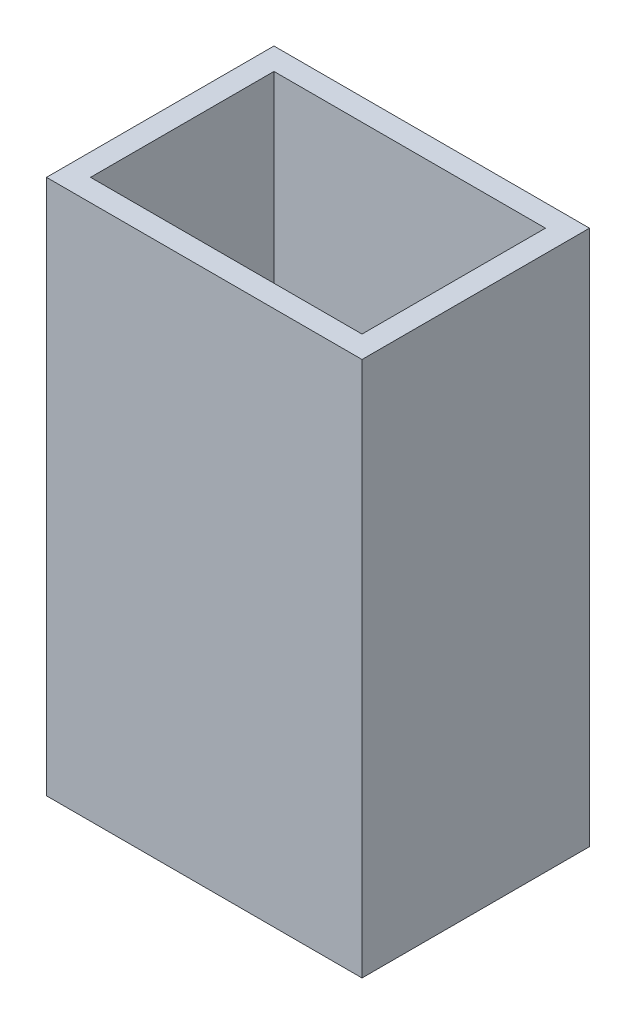
ISO-10303-21;
HEADER;
FILE_DESCRIPTION(('STEP AP214'),'2;1');
FILE_NAME('part.step','',(''),(''),'','','');
FILE_SCHEMA(('AUTOMOTIVE_DESIGN { 1 0 10303 214 1 1 1 1 }'));
ENDSEC;
DATA;
#1=APPLICATION_CONTEXT('core data for automotive mechanical design processes');
#2=APPLICATION_PROTOCOL_DEFINITION('international standard','automotive_design',2000,#1);
#3=PRODUCT_CONTEXT('',#1,'mechanical');
#4=PRODUCT('Part','Part','',(#3));
#5=PRODUCT_RELATED_PRODUCT_CATEGORY('part','',(#4));
#6=PRODUCT_DEFINITION_FORMATION('','',#4);
#7=PRODUCT_DEFINITION_CONTEXT('part definition',#1,'design');
#8=PRODUCT_DEFINITION('design','',#6,#7);
#9=PRODUCT_DEFINITION_SHAPE('','',#8);
#10=(LENGTH_UNIT() NAMED_UNIT(*) SI_UNIT(.MILLI.,.METRE.));
#11=(NAMED_UNIT(*) PLANE_ANGLE_UNIT() SI_UNIT($,.RADIAN.));
#12=(NAMED_UNIT(*) SI_UNIT($,.STERADIAN.) SOLID_ANGLE_UNIT());
#13=UNCERTAINTY_MEASURE_WITH_UNIT(LENGTH_MEASURE(1.E-05),#10,'distance_accuracy_value','');
#14=(GEOMETRIC_REPRESENTATION_CONTEXT(3) GLOBAL_UNCERTAINTY_ASSIGNED_CONTEXT((#13)) GLOBAL_UNIT_ASSIGNED_CONTEXT((#10,
#11,#12)) REPRESENTATION_CONTEXT('',''));
#15=CARTESIAN_POINT('',(0.,0.,0.));
#16=DIRECTION('',(0.,0.,1.));
#17=DIRECTION('',(1.,0.,0.));
#18=AXIS2_PLACEMENT_3D('',#15,#16,#17);
#19=CARTESIAN_POINT('',(-21.5,3.,15.5));
#20=DIRECTION('',(-1.,0.,0.));
#21=DIRECTION('',(0.,0.,1.));
#22=AXIS2_PLACEMENT_3D('',#19,#20,#21);
#23=PLANE('',#22);
#24=DIRECTION('',(0.,0.,-1.));
#25=VECTOR('',#24,1.);
#26=CARTESIAN_POINT('',(-21.5,0.,15.5));
#27=LINE('',#26,#25);
#28=CARTESIAN_POINT('',(-21.5,0.,15.5));
#29=VERTEX_POINT('',#28);
#30=CARTESIAN_POINT('',(-21.5,0.,-15.5));
#31=VERTEX_POINT('',#30);
#32=EDGE_CURVE('E153',#29,#31,#27,.T.);
#33=ORIENTED_EDGE('',*,*,#32,.F.);
#34=DIRECTION('',(0.,-1.,0.));
#35=VECTOR('',#34,1.);
#36=CARTESIAN_POINT('',(-21.5,3.,15.5));
#37=LINE('',#36,#35);
#38=CARTESIAN_POINT('',(-21.5,73.,15.5));
#39=VERTEX_POINT('',#38);
#40=EDGE_CURVE('E11',#39,#29,#37,.T.);
#41=ORIENTED_EDGE('',*,*,#40,.F.);
#42=DIRECTION('',(0.,0.,1.));
#43=VECTOR('',#42,1.);
#44=CARTESIAN_POINT('',(-21.5,73.,0.));
#45=LINE('',#44,#43);
#46=CARTESIAN_POINT('',(-21.5,73.,-15.5));
#47=VERTEX_POINT('',#46);
#48=EDGE_CURVE('E150',#47,#39,#45,.T.);
#49=ORIENTED_EDGE('',*,*,#48,.F.);
#50=DIRECTION('',(0.,-1.,0.));
#51=VECTOR('',#50,1.);
#52=CARTESIAN_POINT('',(-21.5,3.,-15.5));
#53=LINE('',#52,#51);
#54=EDGE_CURVE('E38',#47,#31,#53,.T.);
#55=ORIENTED_EDGE('',*,*,#54,.T.);
#56=EDGE_LOOP('',(#33,#41,#49,#55));
#57=FACE_BOUND('',#56,.T.);
#58=ADVANCED_FACE('F35',(#57),#23,.T.);
#59=CARTESIAN_POINT('',(-21.5,3.,15.5));
#60=DIRECTION('',(0.,0.,-1.));
#61=DIRECTION('',(-1.,0.,0.));
#62=AXIS2_PLACEMENT_3D('',#59,#60,#61);
#63=PLANE('',#62);
#64=DIRECTION('',(1.,0.,0.));
#65=VECTOR('',#64,1.);
#66=CARTESIAN_POINT('',(-21.5,0.,15.5));
#67=LINE('',#66,#65);
#68=CARTESIAN_POINT('',(21.5,0.,15.5));
#69=VERTEX_POINT('',#68);
#70=EDGE_CURVE('E162',#29,#69,#67,.T.);
#71=ORIENTED_EDGE('',*,*,#70,.T.);
#72=DIRECTION('',(0.,-1.,0.));
#73=VECTOR('',#72,1.);
#74=CARTESIAN_POINT('',(21.5,3.,15.5));
#75=LINE('',#74,#73);
#76=CARTESIAN_POINT('',(21.5,73.,15.5));
#77=VERTEX_POINT('',#76);
#78=EDGE_CURVE('E43',#77,#69,#75,.T.);
#79=ORIENTED_EDGE('',*,*,#78,.F.);
#80=DIRECTION('',(1.,0.,0.));
#81=VECTOR('',#80,1.);
#82=CARTESIAN_POINT('',(0.,73.,15.5));
#83=LINE('',#82,#81);
#84=EDGE_CURVE('E116',#39,#77,#83,.T.);
#85=ORIENTED_EDGE('',*,*,#84,.F.);
#86=ORIENTED_EDGE('',*,*,#40,.T.);
#87=EDGE_LOOP('',(#71,#79,#85,#86));
#88=FACE_BOUND('',#87,.T.);
#89=ADVANCED_FACE('F176',(#88),#63,.F.);
#90=CARTESIAN_POINT('',(21.5,3.,15.5));
#91=DIRECTION('',(-1.,0.,0.));
#92=DIRECTION('',(0.,0.,1.));
#93=AXIS2_PLACEMENT_3D('',#90,#91,#92);
#94=PLANE('',#93);
#95=DIRECTION('',(0.,0.,-1.));
#96=VECTOR('',#95,1.);
#97=CARTESIAN_POINT('',(21.5,0.,15.5));
#98=LINE('',#97,#96);
#99=CARTESIAN_POINT('',(21.5,0.,-15.5));
#100=VERTEX_POINT('',#99);
#101=EDGE_CURVE('E159',#69,#100,#98,.T.);
#102=ORIENTED_EDGE('',*,*,#101,.T.);
#103=DIRECTION('',(0.,-1.,0.));
#104=VECTOR('',#103,1.);
#105=CARTESIAN_POINT('',(21.5,3.,-15.5));
#106=LINE('',#105,#104);
#107=CARTESIAN_POINT('',(21.5,73.,-15.5));
#108=VERTEX_POINT('',#107);
#109=EDGE_CURVE('E165',#108,#100,#106,.T.);
#110=ORIENTED_EDGE('',*,*,#109,.F.);
#111=DIRECTION('',(0.,0.,-1.));
#112=VECTOR('',#111,1.);
#113=CARTESIAN_POINT('',(21.5,73.,0.));
#114=LINE('',#113,#112);
#115=EDGE_CURVE('E144',#77,#108,#114,.T.);
#116=ORIENTED_EDGE('',*,*,#115,.F.);
#117=ORIENTED_EDGE('',*,*,#78,.T.);
#118=EDGE_LOOP('',(#102,#110,#116,#117));
#119=FACE_BOUND('',#118,.T.);
#120=ADVANCED_FACE('F179',(#119),#94,.F.);
#121=CARTESIAN_POINT('',(-21.5,3.,-15.5));
#122=DIRECTION('',(0.,0.,-1.));
#123=DIRECTION('',(-1.,0.,0.));
#124=AXIS2_PLACEMENT_3D('',#121,#122,#123);
#125=PLANE('',#124);
#126=DIRECTION('',(1.,0.,0.));
#127=VECTOR('',#126,1.);
#128=CARTESIAN_POINT('',(-21.5,0.,-15.5));
#129=LINE('',#128,#127);
#130=EDGE_CURVE('E156',#31,#100,#129,.T.);
#131=ORIENTED_EDGE('',*,*,#130,.F.);
#132=ORIENTED_EDGE('',*,*,#54,.F.);
#133=DIRECTION('',(-1.,0.,0.));
#134=VECTOR('',#133,1.);
#135=CARTESIAN_POINT('',(0.,73.,-15.5));
#136=LINE('',#135,#134);
#137=EDGE_CURVE('E147',#108,#47,#136,.T.);
#138=ORIENTED_EDGE('',*,*,#137,.F.);
#139=ORIENTED_EDGE('',*,*,#109,.T.);
#140=EDGE_LOOP('',(#131,#132,#138,#139));
#141=FACE_BOUND('',#140,.T.);
#142=ADVANCED_FACE('F172',(#141),#125,.T.);
#143=CARTESIAN_POINT('',(0.,0.,0.));
#144=DIRECTION('',(0.,-1.,0.));
#145=DIRECTION('',(0.,0.,-1.));
#146=AXIS2_PLACEMENT_3D('',#143,#144,#145);
#147=PLANE('',#146);
#148=CARTESIAN_POINT('',(-12.5,0.,-9.5));
#149=DIRECTION('',(0.,1.,0.));
#150=DIRECTION('',(0.,0.,1.));
#151=AXIS2_PLACEMENT_3D('',#148,#149,#150);
#152=CIRCLE('',#151,1.7);
#153=CARTESIAN_POINT('',(-12.5,0.,-7.80000000000001));
#154=VERTEX_POINT('',#153);
#155=EDGE_CURVE('E330',#154,#154,#152,.T.);
#156=ORIENTED_EDGE('',*,*,#155,.T.);
#157=EDGE_LOOP('',(#156));
#158=FACE_BOUND('',#157,.T.);
#159=CARTESIAN_POINT('',(12.5,0.,-9.5));
#160=DIRECTION('',(0.,1.,0.));
#161=DIRECTION('',(0.,0.,1.));
#162=AXIS2_PLACEMENT_3D('',#159,#160,#161);
#163=CIRCLE('',#162,1.7);
#164=CARTESIAN_POINT('',(12.5,0.,-7.80000000000001));
#165=VERTEX_POINT('',#164);
#166=EDGE_CURVE('E340',#165,#165,#163,.T.);
#167=ORIENTED_EDGE('',*,*,#166,.T.);
#168=EDGE_LOOP('',(#167));
#169=FACE_BOUND('',#168,.T.);
#170=CARTESIAN_POINT('',(12.5,0.,9.5));
#171=DIRECTION('',(0.,1.,0.));
#172=DIRECTION('',(0.,0.,1.));
#173=AXIS2_PLACEMENT_3D('',#170,#171,#172);
#174=CIRCLE('',#173,1.7);
#175=CARTESIAN_POINT('',(12.5,0.,11.2));
#176=VERTEX_POINT('',#175);
#177=EDGE_CURVE('E346',#176,#176,#174,.T.);
#178=ORIENTED_EDGE('',*,*,#177,.T.);
#179=EDGE_LOOP('',(#178));
#180=FACE_BOUND('',#179,.T.);
#181=CARTESIAN_POINT('',(-12.5,0.,9.5));
#182=DIRECTION('',(0.,1.,0.));
#183=DIRECTION('',(0.,0.,1.));
#184=AXIS2_PLACEMENT_3D('',#181,#182,#183);
#185=CIRCLE('',#184,1.7);
#186=CARTESIAN_POINT('',(-12.5,0.,11.2));
#187=VERTEX_POINT('',#186);
#188=EDGE_CURVE('E131',#187,#187,#185,.T.);
#189=ORIENTED_EDGE('',*,*,#188,.T.);
#190=EDGE_LOOP('',(#189));
#191=FACE_BOUND('',#190,.T.);
#192=ORIENTED_EDGE('',*,*,#32,.T.);
#193=ORIENTED_EDGE('',*,*,#130,.T.);
#194=ORIENTED_EDGE('',*,*,#101,.F.);
#195=ORIENTED_EDGE('',*,*,#70,.F.);
#196=EDGE_LOOP('',(#192,#193,#194,#195));
#197=FACE_BOUND('',#196,.T.);
#198=ADVANCED_FACE('F175',(#158,#169,#180,#191,#197),#147,.T.);
#199=CARTESIAN_POINT('',(0.,73.,0.));
#200=DIRECTION('',(0.,1.,0.));
#201=DIRECTION('',(0.,0.,1.));
#202=AXIS2_PLACEMENT_3D('',#199,#200,#201);
#203=PLANE('',#202);
#204=ORIENTED_EDGE('',*,*,#84,.T.);
#205=ORIENTED_EDGE('',*,*,#115,.T.);
#206=ORIENTED_EDGE('',*,*,#137,.T.);
#207=ORIENTED_EDGE('',*,*,#48,.T.);
#208=EDGE_LOOP('',(#204,#205,#206,#207));
#209=FACE_BOUND('',#208,.T.);
#210=DIRECTION('',(0.,0.,-1.));
#211=VECTOR('',#210,1.);
#212=CARTESIAN_POINT('',(18.5,73.,0.));
#213=LINE('',#212,#211);
#214=CARTESIAN_POINT('',(18.5,73.,12.5));
#215=VERTEX_POINT('',#214);
#216=CARTESIAN_POINT('',(18.5,73.,-12.5));
#217=VERTEX_POINT('',#216);
#218=EDGE_CURVE('E108',#215,#217,#213,.T.);
#219=ORIENTED_EDGE('',*,*,#218,.F.);
#220=DIRECTION('',(1.,0.,0.));
#221=VECTOR('',#220,1.);
#222=CARTESIAN_POINT('',(0.,73.,12.5));
#223=LINE('',#222,#221);
#224=CARTESIAN_POINT('',(-18.5,73.,12.5));
#225=VERTEX_POINT('',#224);
#226=EDGE_CURVE('E100',#225,#215,#223,.T.);
#227=ORIENTED_EDGE('',*,*,#226,.F.);
#228=DIRECTION('',(0.,0.,1.));
#229=VECTOR('',#228,1.);
#230=CARTESIAN_POINT('',(-18.5,73.,0.));
#231=LINE('',#230,#229);
#232=CARTESIAN_POINT('',(-18.5,73.,-12.5));
#233=VERTEX_POINT('',#232);
#234=EDGE_CURVE('E124',#233,#225,#231,.T.);
#235=ORIENTED_EDGE('',*,*,#234,.F.);
#236=DIRECTION('',(-1.,0.,0.));
#237=VECTOR('',#236,1.);
#238=CARTESIAN_POINT('',(0.,73.,-12.5));
#239=LINE('',#238,#237);
#240=EDGE_CURVE('E122',#217,#233,#239,.T.);
#241=ORIENTED_EDGE('',*,*,#240,.F.);
#242=EDGE_LOOP('',(#219,#227,#235,#241));
#243=FACE_BOUND('',#242,.T.);
#244=ADVANCED_FACE('F120',(#209,#243),#203,.T.);
#245=CARTESIAN_POINT('',(0.,73.,12.5));
#246=DIRECTION('',(0.,0.,-1.));
#247=DIRECTION('',(-1.,0.,0.));
#248=AXIS2_PLACEMENT_3D('',#245,#246,#247);
#249=PLANE('',#248);
#250=DIRECTION('',(1.,0.,0.));
#251=VECTOR('',#250,1.);
#252=CARTESIAN_POINT('',(0.,3.,12.5));
#253=LINE('',#252,#251);
#254=CARTESIAN_POINT('',(-18.5,3.,12.5));
#255=VERTEX_POINT('',#254);
#256=CARTESIAN_POINT('',(18.5,3.,12.5));
#257=VERTEX_POINT('',#256);
#258=EDGE_CURVE('E129',#255,#257,#253,.T.);
#259=ORIENTED_EDGE('',*,*,#258,.F.);
#260=DIRECTION('',(0.,-1.,0.));
#261=VECTOR('',#260,1.);
#262=CARTESIAN_POINT('',(-18.5,73.,12.5));
#263=LINE('',#262,#261);
#264=EDGE_CURVE('E51',#225,#255,#263,.T.);
#265=ORIENTED_EDGE('',*,*,#264,.F.);
#266=ORIENTED_EDGE('',*,*,#226,.T.);
#267=DIRECTION('',(0.,-1.,0.));
#268=VECTOR('',#267,1.);
#269=CARTESIAN_POINT('',(18.5,73.,12.5));
#270=LINE('',#269,#268);
#271=EDGE_CURVE('E103',#215,#257,#270,.T.);
#272=ORIENTED_EDGE('',*,*,#271,.T.);
#273=EDGE_LOOP('',(#259,#265,#266,#272));
#274=FACE_BOUND('',#273,.T.);
#275=ADVANCED_FACE('F102',(#274),#249,.T.);
#276=CARTESIAN_POINT('',(18.5,73.,0.));
#277=DIRECTION('',(-1.,0.,0.));
#278=DIRECTION('',(0.,0.,1.));
#279=AXIS2_PLACEMENT_3D('',#276,#277,#278);
#280=PLANE('',#279);
#281=DIRECTION('',(0.,0.,-1.));
#282=VECTOR('',#281,1.);
#283=CARTESIAN_POINT('',(18.5,3.,0.));
#284=LINE('',#283,#282);
#285=CARTESIAN_POINT('',(18.5,3.,-12.5));
#286=VERTEX_POINT('',#285);
#287=EDGE_CURVE('E115',#257,#286,#284,.T.);
#288=ORIENTED_EDGE('',*,*,#287,.F.);
#289=ORIENTED_EDGE('',*,*,#271,.F.);
#290=ORIENTED_EDGE('',*,*,#218,.T.);
#291=DIRECTION('',(0.,-1.,0.));
#292=VECTOR('',#291,1.);
#293=CARTESIAN_POINT('',(18.5,73.,-12.5));
#294=LINE('',#293,#292);
#295=EDGE_CURVE('E117',#217,#286,#294,.T.);
#296=ORIENTED_EDGE('',*,*,#295,.T.);
#297=EDGE_LOOP('',(#288,#289,#290,#296));
#298=FACE_BOUND('',#297,.T.);
#299=ADVANCED_FACE('F112',(#298),#280,.T.);
#300=CARTESIAN_POINT('',(0.,73.,-12.5));
#301=DIRECTION('',(0.,0.,1.));
#302=DIRECTION('',(1.,0.,0.));
#303=AXIS2_PLACEMENT_3D('',#300,#301,#302);
#304=PLANE('',#303);
#305=DIRECTION('',(-1.,0.,0.));
#306=VECTOR('',#305,1.);
#307=CARTESIAN_POINT('',(0.,3.,-12.5));
#308=LINE('',#307,#306);
#309=CARTESIAN_POINT('',(-18.5,3.,-12.5));
#310=VERTEX_POINT('',#309);
#311=EDGE_CURVE('E133',#286,#310,#308,.T.);
#312=ORIENTED_EDGE('',*,*,#311,.F.);
#313=ORIENTED_EDGE('',*,*,#295,.F.);
#314=ORIENTED_EDGE('',*,*,#240,.T.);
#315=DIRECTION('',(0.,-1.,0.));
#316=VECTOR('',#315,1.);
#317=CARTESIAN_POINT('',(-18.5,73.,-12.5));
#318=LINE('',#317,#316);
#319=EDGE_CURVE('E139',#233,#310,#318,.T.);
#320=ORIENTED_EDGE('',*,*,#319,.T.);
#321=EDGE_LOOP('',(#312,#313,#314,#320));
#322=FACE_BOUND('',#321,.T.);
#323=ADVANCED_FACE('F274',(#322),#304,.T.);
#324=CARTESIAN_POINT('',(-18.5,73.,0.));
#325=DIRECTION('',(1.,0.,0.));
#326=DIRECTION('',(0.,0.,-1.));
#327=AXIS2_PLACEMENT_3D('',#324,#325,#326);
#328=PLANE('',#327);
#329=DIRECTION('',(0.,0.,1.));
#330=VECTOR('',#329,1.);
#331=CARTESIAN_POINT('',(-18.5,3.,0.));
#332=LINE('',#331,#330);
#333=EDGE_CURVE('E109',#310,#255,#332,.T.);
#334=ORIENTED_EDGE('',*,*,#333,.F.);
#335=ORIENTED_EDGE('',*,*,#319,.F.);
#336=ORIENTED_EDGE('',*,*,#234,.T.);
#337=ORIENTED_EDGE('',*,*,#264,.T.);
#338=EDGE_LOOP('',(#334,#335,#336,#337));
#339=FACE_BOUND('',#338,.T.);
#340=ADVANCED_FACE('F217',(#339),#328,.T.);
#341=CARTESIAN_POINT('',(0.,3.,0.));
#342=DIRECTION('',(0.,-1.,0.));
#343=DIRECTION('',(0.,0.,-1.));
#344=AXIS2_PLACEMENT_3D('',#341,#342,#343);
#345=PLANE('',#344);
#346=CARTESIAN_POINT('',(-12.5,3.,-9.5));
#347=DIRECTION('',(0.,1.,0.));
#348=DIRECTION('',(0.,0.,1.));
#349=AXIS2_PLACEMENT_3D('',#346,#347,#348);
#350=CIRCLE('',#349,1.69999999999999);
#351=CARTESIAN_POINT('',(-12.5,3.,-7.80000000000001));
#352=VERTEX_POINT('',#351);
#353=EDGE_CURVE('E333',#352,#352,#350,.T.);
#354=ORIENTED_EDGE('',*,*,#353,.F.);
#355=EDGE_LOOP('',(#354));
#356=FACE_BOUND('',#355,.T.);
#357=CARTESIAN_POINT('',(12.5,3.,-9.5));
#358=DIRECTION('',(0.,1.,0.));
#359=DIRECTION('',(0.,0.,1.));
#360=AXIS2_PLACEMENT_3D('',#357,#358,#359);
#361=CIRCLE('',#360,1.69999999999999);
#362=CARTESIAN_POINT('',(12.5,3.,-7.80000000000001));
#363=VERTEX_POINT('',#362);
#364=EDGE_CURVE('E335',#363,#363,#361,.T.);
#365=ORIENTED_EDGE('',*,*,#364,.F.);
#366=EDGE_LOOP('',(#365));
#367=FACE_BOUND('',#366,.T.);
#368=CARTESIAN_POINT('',(12.5,3.,9.5));
#369=DIRECTION('',(0.,1.,0.));
#370=DIRECTION('',(0.,0.,1.));
#371=AXIS2_PLACEMENT_3D('',#368,#369,#370);
#372=CIRCLE('',#371,1.69999999999999);
#373=CARTESIAN_POINT('',(12.5,3.,11.2));
#374=VERTEX_POINT('',#373);
#375=EDGE_CURVE('E343',#374,#374,#372,.T.);
#376=ORIENTED_EDGE('',*,*,#375,.F.);
#377=EDGE_LOOP('',(#376));
#378=FACE_BOUND('',#377,.T.);
#379=CARTESIAN_POINT('',(-12.5,3.,9.5));
#380=DIRECTION('',(0.,1.,0.));
#381=DIRECTION('',(0.,0.,1.));
#382=AXIS2_PLACEMENT_3D('',#379,#380,#381);
#383=CIRCLE('',#382,1.69999999999999);
#384=CARTESIAN_POINT('',(-12.5,3.,11.2));
#385=VERTEX_POINT('',#384);
#386=EDGE_CURVE('E349',#385,#385,#383,.T.);
#387=ORIENTED_EDGE('',*,*,#386,.F.);
#388=EDGE_LOOP('',(#387));
#389=FACE_BOUND('',#388,.T.);
#390=ORIENTED_EDGE('',*,*,#333,.T.);
#391=ORIENTED_EDGE('',*,*,#258,.T.);
#392=ORIENTED_EDGE('',*,*,#287,.T.);
#393=ORIENTED_EDGE('',*,*,#311,.T.);
#394=EDGE_LOOP('',(#390,#391,#392,#393));
#395=FACE_BOUND('',#394,.T.);
#396=ADVANCED_FACE('F222',(#356,#367,#378,#389,#395),#345,.F.);
#397=CARTESIAN_POINT('',(-12.5,3.,9.5));
#398=DIRECTION('',(0.,1.,0.));
#399=DIRECTION('',(0.,0.,1.));
#400=AXIS2_PLACEMENT_3D('',#397,#398,#399);
#401=CYLINDRICAL_SURFACE('',#400,1.69999999999999);
#402=ORIENTED_EDGE('',*,*,#188,.F.);
#403=EDGE_LOOP('',(#402));
#404=FACE_BOUND('',#403,.T.);
#405=ORIENTED_EDGE('',*,*,#386,.T.);
#406=EDGE_LOOP('',(#405));
#407=FACE_BOUND('',#406,.T.);
#408=ADVANCED_FACE('F226',(#404,#407),#401,.F.);
#409=CARTESIAN_POINT('',(12.5,3.,9.5));
#410=DIRECTION('',(0.,1.,0.));
#411=DIRECTION('',(0.,0.,1.));
#412=AXIS2_PLACEMENT_3D('',#409,#410,#411);
#413=CYLINDRICAL_SURFACE('',#412,1.69999999999999);
#414=ORIENTED_EDGE('',*,*,#177,.F.);
#415=EDGE_LOOP('',(#414));
#416=FACE_BOUND('',#415,.T.);
#417=ORIENTED_EDGE('',*,*,#375,.T.);
#418=EDGE_LOOP('',(#417));
#419=FACE_BOUND('',#418,.T.);
#420=ADVANCED_FACE('F236',(#416,#419),#413,.F.);
#421=CARTESIAN_POINT('',(12.5,3.,-9.5));
#422=DIRECTION('',(0.,1.,0.));
#423=DIRECTION('',(0.,0.,1.));
#424=AXIS2_PLACEMENT_3D('',#421,#422,#423);
#425=CYLINDRICAL_SURFACE('',#424,1.69999999999999);
#426=ORIENTED_EDGE('',*,*,#166,.F.);
#427=EDGE_LOOP('',(#426));
#428=FACE_BOUND('',#427,.T.);
#429=ORIENTED_EDGE('',*,*,#364,.T.);
#430=EDGE_LOOP('',(#429));
#431=FACE_BOUND('',#430,.T.);
#432=ADVANCED_FACE('F246',(#428,#431),#425,.F.);
#433=CARTESIAN_POINT('',(-12.5,3.,-9.5));
#434=DIRECTION('',(0.,1.,0.));
#435=DIRECTION('',(0.,0.,1.));
#436=AXIS2_PLACEMENT_3D('',#433,#434,#435);
#437=CYLINDRICAL_SURFACE('',#436,1.69999999999999);
#438=ORIENTED_EDGE('',*,*,#155,.F.);
#439=EDGE_LOOP('',(#438));
#440=FACE_BOUND('',#439,.T.);
#441=ORIENTED_EDGE('',*,*,#353,.T.);
#442=EDGE_LOOP('',(#441));
#443=FACE_BOUND('',#442,.T.);
#444=ADVANCED_FACE('F256',(#440,#443),#437,.F.);
#445=CLOSED_SHELL('',(#58,#89,#120,#142,#198,#244,#275,#299,#323,#340,#396,#408,#420,#432,#444));
#446=MANIFOLD_SOLID_BREP('B2',#445);
#447=ADVANCED_BREP_SHAPE_REPRESENTATION('',(#18,#446),#14);
#448=SHAPE_DEFINITION_REPRESENTATION(#9,#447);
ENDSEC;
END-ISO-10303-21;
